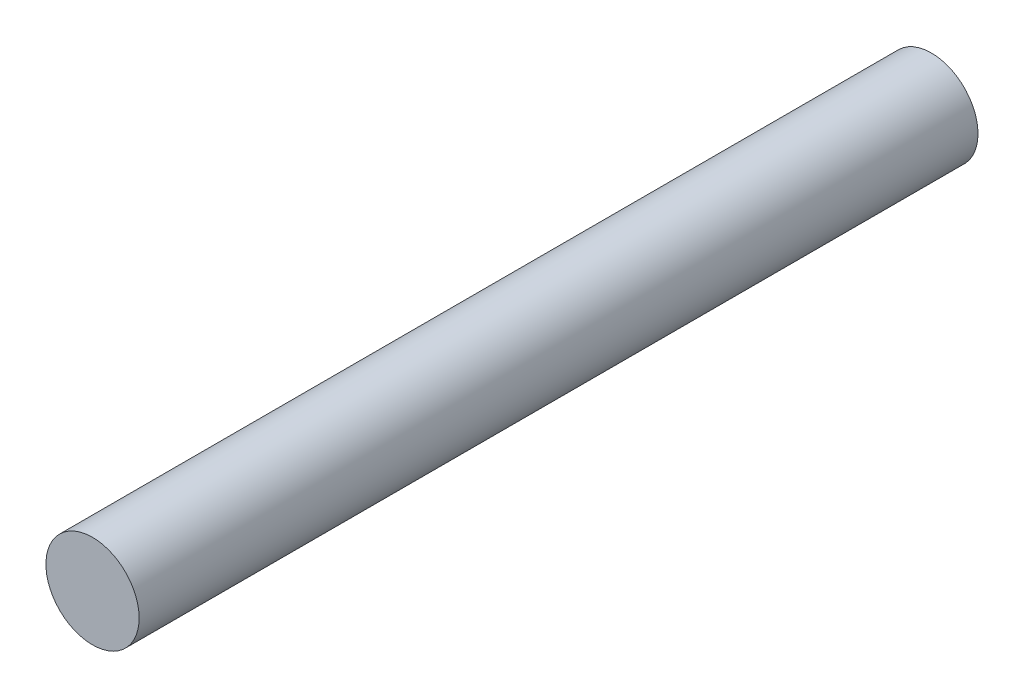
ISO-10303-21;
HEADER;
FILE_DESCRIPTION(('STEP AP214'),'2;1');
FILE_NAME('part.step','',(''),(''),'','','');
FILE_SCHEMA(('AUTOMOTIVE_DESIGN { 1 0 10303 214 1 1 1 1 }'));
ENDSEC;
DATA;
#1=APPLICATION_CONTEXT('core data for automotive mechanical design processes');
#2=APPLICATION_PROTOCOL_DEFINITION('international standard','automotive_design',2000,#1);
#3=PRODUCT_CONTEXT('',#1,'mechanical');
#4=PRODUCT('Part','Part','',(#3));
#5=PRODUCT_RELATED_PRODUCT_CATEGORY('part','',(#4));
#6=PRODUCT_DEFINITION_FORMATION('','',#4);
#7=PRODUCT_DEFINITION_CONTEXT('part definition',#1,'design');
#8=PRODUCT_DEFINITION('design','',#6,#7);
#9=PRODUCT_DEFINITION_SHAPE('','',#8);
#10=(LENGTH_UNIT() NAMED_UNIT(*) SI_UNIT(.MILLI.,.METRE.));
#11=(NAMED_UNIT(*) PLANE_ANGLE_UNIT() SI_UNIT($,.RADIAN.));
#12=(NAMED_UNIT(*) SI_UNIT($,.STERADIAN.) SOLID_ANGLE_UNIT());
#13=UNCERTAINTY_MEASURE_WITH_UNIT(LENGTH_MEASURE(1.E-05),#10,'distance_accuracy_value','');
#14=(GEOMETRIC_REPRESENTATION_CONTEXT(3) GLOBAL_UNCERTAINTY_ASSIGNED_CONTEXT((#13)) GLOBAL_UNIT_ASSIGNED_CONTEXT((#10,
#11,#12)) REPRESENTATION_CONTEXT('',''));
#15=CARTESIAN_POINT('',(0.,0.,0.));
#16=DIRECTION('',(0.,0.,1.));
#17=DIRECTION('',(1.,0.,0.));
#18=AXIS2_PLACEMENT_3D('',#15,#16,#17);
#19=CARTESIAN_POINT('',(-5.824,3.899,-9.1));
#20=DIRECTION('',(0.,0.,-1.));
#21=DIRECTION('',(-1.,0.,0.));
#22=AXIS2_PLACEMENT_3D('',#19,#20,#21);
#23=PLANE('',#22);
#24=CARTESIAN_POINT('',(-6.125,4.2,-9.1));
#25=DIRECTION('',(0.,0.,1.));
#26=DIRECTION('',(1.,0.,0.));
#27=AXIS2_PLACEMENT_3D('',#24,#25,#26);
#28=CIRCLE('',#27,0.300000000000001);
#29=CARTESIAN_POINT('',(-5.825,4.2,-9.1));
#30=VERTEX_POINT('',#29);
#31=EDGE_CURVE('E19',#30,#30,#28,.T.);
#32=ORIENTED_EDGE('',*,*,#31,.F.);
#33=EDGE_LOOP('',(#32));
#34=FACE_BOUND('',#33,.T.);
#35=ADVANCED_FACE('F15',(#34),#23,.T.);
#36=CARTESIAN_POINT('',(-6.125,4.2,-9.1));
#37=DIRECTION('',(0.,0.,1.));
#38=DIRECTION('',(1.,0.,0.));
#39=AXIS2_PLACEMENT_3D('',#36,#37,#38);
#40=CYLINDRICAL_SURFACE('',#39,0.300000000000001);
#41=CARTESIAN_POINT('',(-6.125,4.2,-3.7));
#42=DIRECTION('',(0.,0.,1.));
#43=DIRECTION('',(1.,0.,0.));
#44=AXIS2_PLACEMENT_3D('',#41,#42,#43);
#45=CIRCLE('',#44,0.300000000000001);
#46=CARTESIAN_POINT('',(-5.825,4.2,-3.7));
#47=VERTEX_POINT('',#46);
#48=EDGE_CURVE('E10',#47,#47,#45,.T.);
#49=ORIENTED_EDGE('',*,*,#48,.F.);
#50=EDGE_LOOP('',(#49));
#51=FACE_BOUND('',#50,.T.);
#52=ORIENTED_EDGE('',*,*,#31,.T.);
#53=EDGE_LOOP('',(#52));
#54=FACE_BOUND('',#53,.T.);
#55=ADVANCED_FACE('F28',(#51,#54),#40,.T.);
#56=CARTESIAN_POINT('',(-5.824,4.501,-3.7));
#57=DIRECTION('',(0.,0.,1.));
#58=DIRECTION('',(-1.,0.,0.));
#59=AXIS2_PLACEMENT_3D('',#56,#57,#58);
#60=PLANE('',#59);
#61=ORIENTED_EDGE('',*,*,#48,.T.);
#62=EDGE_LOOP('',(#61));
#63=FACE_BOUND('',#62,.T.);
#64=ADVANCED_FACE('F17',(#63),#60,.T.);
#65=CLOSED_SHELL('',(#35,#55,#64));
#66=MANIFOLD_SOLID_BREP('B1',#65);
#67=ADVANCED_BREP_SHAPE_REPRESENTATION('',(#18,#66),#14);
#68=SHAPE_DEFINITION_REPRESENTATION(#9,#67);
ENDSEC;
END-ISO-10303-21;
